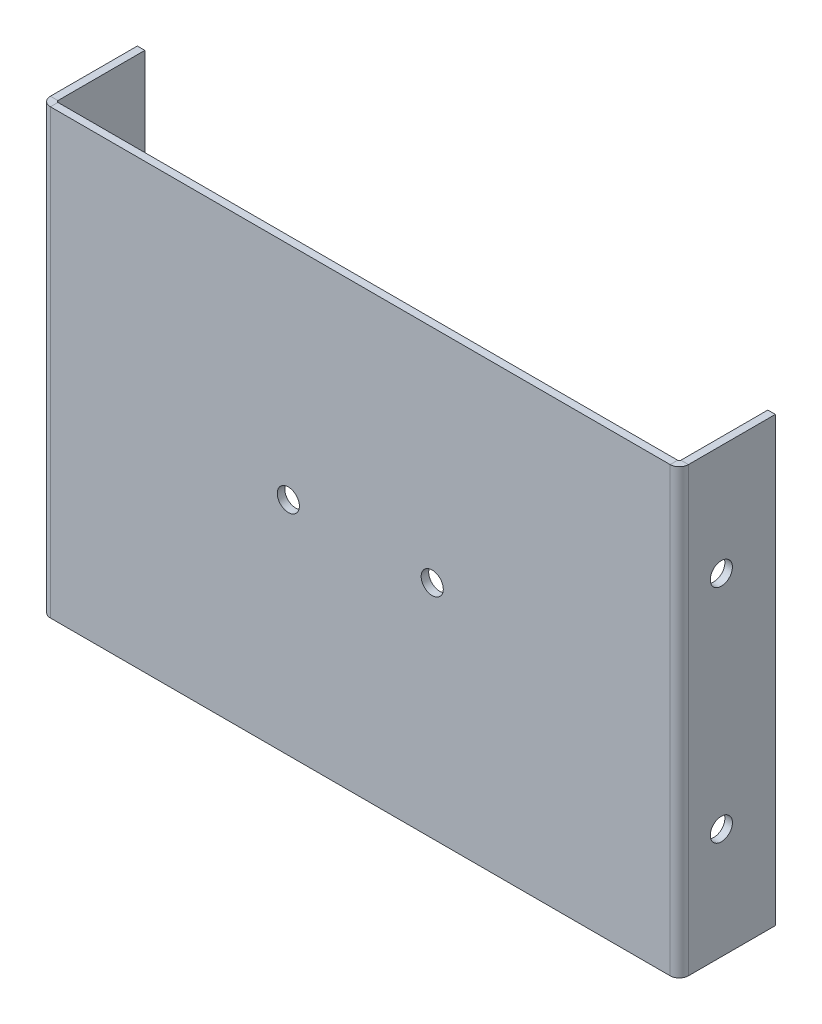
ISO-10303-21;
HEADER;
FILE_DESCRIPTION(('STEP AP214'),'2;1');
FILE_NAME('part.step','',(''),(''),'','','');
FILE_SCHEMA(('AUTOMOTIVE_DESIGN { 1 0 10303 214 1 1 1 1 }'));
ENDSEC;
DATA;
#1=APPLICATION_CONTEXT('core data for automotive mechanical design processes');
#2=APPLICATION_PROTOCOL_DEFINITION('international standard','automotive_design',2000,#1);
#3=PRODUCT_CONTEXT('',#1,'mechanical');
#4=PRODUCT('Part','Part','',(#3));
#5=PRODUCT_RELATED_PRODUCT_CATEGORY('part','',(#4));
#6=PRODUCT_DEFINITION_FORMATION('','',#4);
#7=PRODUCT_DEFINITION_CONTEXT('part definition',#1,'design');
#8=PRODUCT_DEFINITION('design','',#6,#7);
#9=PRODUCT_DEFINITION_SHAPE('','',#8);
#10=(LENGTH_UNIT() NAMED_UNIT(*) SI_UNIT(.MILLI.,.METRE.));
#11=(NAMED_UNIT(*) PLANE_ANGLE_UNIT() SI_UNIT($,.RADIAN.));
#12=(NAMED_UNIT(*) SI_UNIT($,.STERADIAN.) SOLID_ANGLE_UNIT());
#13=UNCERTAINTY_MEASURE_WITH_UNIT(LENGTH_MEASURE(1.E-05),#10,'distance_accuracy_value','');
#14=(GEOMETRIC_REPRESENTATION_CONTEXT(3) GLOBAL_UNCERTAINTY_ASSIGNED_CONTEXT((#13)) GLOBAL_UNIT_ASSIGNED_CONTEXT((#10,
#11,#12)) REPRESENTATION_CONTEXT('',''));
#15=CARTESIAN_POINT('',(0.,0.,0.));
#16=DIRECTION('',(0.,0.,1.));
#17=DIRECTION('',(1.,0.,0.));
#18=AXIS2_PLACEMENT_3D('',#15,#16,#17);
#19=CARTESIAN_POINT('',(0.,0.,-3.4));
#20=DIRECTION('',(0.,0.,-1.));
#21=DIRECTION('',(-1.,0.,0.));
#22=AXIS2_PLACEMENT_3D('',#19,#20,#21);
#23=PLANE('',#22);
#24=CARTESIAN_POINT('',(-176.6,-100.,-3.4));
#25=DIRECTION('',(0.,0.,1.));
#26=DIRECTION('',(-1.,0.,0.));
#27=AXIS2_PLACEMENT_3D('',#24,#25,#26);
#28=CIRCLE('',#27,5.00000000000002);
#29=CARTESIAN_POINT('',(-181.6,-100.,-3.4));
#30=VERTEX_POINT('',#29);
#31=EDGE_CURVE('E326',#30,#30,#28,.T.);
#32=ORIENTED_EDGE('',*,*,#31,.T.);
#33=EDGE_LOOP('',(#32));
#34=FACE_BOUND('',#33,.T.);
#35=CARTESIAN_POINT('',(-111.6,-100.,-3.4));
#36=DIRECTION('',(0.,0.,1.));
#37=DIRECTION('',(1.,0.,0.));
#38=AXIS2_PLACEMENT_3D('',#35,#36,#37);
#39=CIRCLE('',#38,5.00000000000001);
#40=CARTESIAN_POINT('',(-106.6,-100.,-3.4));
#41=VERTEX_POINT('',#40);
#42=EDGE_CURVE('E332',#41,#41,#39,.T.);
#43=ORIENTED_EDGE('',*,*,#42,.T.);
#44=EDGE_LOOP('',(#43));
#45=FACE_BOUND('',#44,.T.);
#46=DIRECTION('',(1.,0.,0.));
#47=VECTOR('',#46,1.);
#48=CARTESIAN_POINT('',(0.,-200.,-3.4));
#49=LINE('',#48,#47);
#50=CARTESIAN_POINT('',(-284.0634,-200.,-3.40000000000002));
#51=VERTEX_POINT('',#50);
#52=CARTESIAN_POINT('',(-4.13659999999997,-200.,-3.4));
#53=VERTEX_POINT('',#52);
#54=EDGE_CURVE('E13',#51,#53,#49,.T.);
#55=ORIENTED_EDGE('',*,*,#54,.F.);
#56=DIRECTION('',(0.,1.,0.));
#57=VECTOR('',#56,1.);
#58=CARTESIAN_POINT('',(-284.0634,0.,-3.40000000000002));
#59=LINE('',#58,#57);
#60=CARTESIAN_POINT('',(-284.0634,0.,-3.40000000000002));
#61=VERTEX_POINT('',#60);
#62=EDGE_CURVE('E254',#61,#51,#59,.F.);
#63=ORIENTED_EDGE('',*,*,#62,.F.);
#64=DIRECTION('',(-1.,0.,0.));
#65=VECTOR('',#64,1.);
#66=CARTESIAN_POINT('',(-288.2,0.,-3.4));
#67=LINE('',#66,#65);
#68=CARTESIAN_POINT('',(-4.13659999999999,0.,-3.4));
#69=VERTEX_POINT('',#68);
#70=EDGE_CURVE('E102',#69,#61,#67,.T.);
#71=ORIENTED_EDGE('',*,*,#70,.F.);
#72=DIRECTION('',(0.,-1.,0.));
#73=VECTOR('',#72,1.);
#74=CARTESIAN_POINT('',(-4.13659999999997,-200.,-3.40000000000001));
#75=LINE('',#74,#73);
#76=EDGE_CURVE('E318',#53,#69,#75,.F.);
#77=ORIENTED_EDGE('',*,*,#76,.F.);
#78=EDGE_LOOP('',(#55,#63,#71,#77));
#79=FACE_BOUND('',#78,.T.);
#80=ADVANCED_FACE('F93',(#34,#45,#79),#23,.T.);
#81=CARTESIAN_POINT('',(0.,0.,0.));
#82=DIRECTION('',(0.,0.,-1.));
#83=DIRECTION('',(-1.,0.,0.));
#84=AXIS2_PLACEMENT_3D('',#81,#82,#83);
#85=PLANE('',#84);
#86=CARTESIAN_POINT('',(-176.6,-100.,0.));
#87=DIRECTION('',(0.,0.,1.));
#88=DIRECTION('',(-1.,0.,0.));
#89=AXIS2_PLACEMENT_3D('',#86,#87,#88);
#90=CIRCLE('',#89,5.00000000000002);
#91=CARTESIAN_POINT('',(-181.6,-100.,0.));
#92=VERTEX_POINT('',#91);
#93=EDGE_CURVE('E324',#92,#92,#90,.T.);
#94=ORIENTED_EDGE('',*,*,#93,.F.);
#95=EDGE_LOOP('',(#94));
#96=FACE_BOUND('',#95,.T.);
#97=CARTESIAN_POINT('',(-111.6,-100.,0.));
#98=DIRECTION('',(0.,0.,1.));
#99=DIRECTION('',(1.,0.,0.));
#100=AXIS2_PLACEMENT_3D('',#97,#98,#99);
#101=CIRCLE('',#100,5.00000000000001);
#102=CARTESIAN_POINT('',(-106.6,-100.,0.));
#103=VERTEX_POINT('',#102);
#104=EDGE_CURVE('E329',#103,#103,#101,.T.);
#105=ORIENTED_EDGE('',*,*,#104,.F.);
#106=EDGE_LOOP('',(#105));
#107=FACE_BOUND('',#106,.T.);
#108=DIRECTION('',(0.,1.,0.));
#109=VECTOR('',#108,1.);
#110=CARTESIAN_POINT('',(-284.0634,0.,0.));
#111=LINE('',#110,#109);
#112=CARTESIAN_POINT('',(-284.0634,0.,0.));
#113=VERTEX_POINT('',#112);
#114=CARTESIAN_POINT('',(-284.0634,-200.,0.));
#115=VERTEX_POINT('',#114);
#116=EDGE_CURVE('E192',#113,#115,#111,.F.);
#117=ORIENTED_EDGE('',*,*,#116,.T.);
#118=DIRECTION('',(1.,0.,0.));
#119=VECTOR('',#118,1.);
#120=CARTESIAN_POINT('',(0.,-200.,0.));
#121=LINE('',#120,#119);
#122=CARTESIAN_POINT('',(-4.13659999999992,-200.,0.));
#123=VERTEX_POINT('',#122);
#124=EDGE_CURVE('E97',#115,#123,#121,.T.);
#125=ORIENTED_EDGE('',*,*,#124,.T.);
#126=DIRECTION('',(0.,-1.,0.));
#127=VECTOR('',#126,1.);
#128=CARTESIAN_POINT('',(-4.13659999999992,-200.,0.));
#129=LINE('',#128,#127);
#130=CARTESIAN_POINT('',(-4.13659999999999,0.,0.));
#131=VERTEX_POINT('',#130);
#132=EDGE_CURVE('E306',#123,#131,#129,.F.);
#133=ORIENTED_EDGE('',*,*,#132,.T.);
#134=DIRECTION('',(-1.,0.,0.));
#135=VECTOR('',#134,1.);
#136=CARTESIAN_POINT('',(-288.2,0.,0.));
#137=LINE('',#136,#135);
#138=EDGE_CURVE('E335',#131,#113,#137,.T.);
#139=ORIENTED_EDGE('',*,*,#138,.T.);
#140=EDGE_LOOP('',(#117,#125,#133,#139));
#141=FACE_BOUND('',#140,.T.);
#142=ADVANCED_FACE('F340',(#96,#107,#141),#85,.F.);
#143=CARTESIAN_POINT('',(-288.2,0.,-3.4));
#144=DIRECTION('',(0.,1.,0.));
#145=DIRECTION('',(0.,0.,1.));
#146=AXIS2_PLACEMENT_3D('',#143,#144,#145);
#147=PLANE('',#146);
#148=ORIENTED_EDGE('',*,*,#70,.T.);
#149=DIRECTION('',(0.,0.,1.));
#150=VECTOR('',#149,1.);
#151=CARTESIAN_POINT('',(-284.0634,0.,-3.40000000000002));
#152=LINE('',#151,#150);
#153=EDGE_CURVE('E250',#61,#113,#152,.T.);
#154=ORIENTED_EDGE('',*,*,#153,.T.);
#155=ORIENTED_EDGE('',*,*,#138,.F.);
#156=DIRECTION('',(0.,0.,1.));
#157=VECTOR('',#156,1.);
#158=CARTESIAN_POINT('',(-4.13659999999997,0.,-3.40000000000001));
#159=LINE('',#158,#157);
#160=EDGE_CURVE('E116',#69,#131,#159,.T.);
#161=ORIENTED_EDGE('',*,*,#160,.F.);
#162=EDGE_LOOP('',(#148,#154,#155,#161));
#163=FACE_BOUND('',#162,.T.);
#164=ADVANCED_FACE('F95',(#163),#147,.T.);
#165=CARTESIAN_POINT('',(0.,-200.,-3.4));
#166=DIRECTION('',(0.,-1.,0.));
#167=DIRECTION('',(1.,0.,0.));
#168=AXIS2_PLACEMENT_3D('',#165,#166,#167);
#169=PLANE('',#168);
#170=DIRECTION('',(0.,0.,1.));
#171=VECTOR('',#170,1.);
#172=CARTESIAN_POINT('',(-284.0634,-200.,-3.40000000000002));
#173=LINE('',#172,#171);
#174=EDGE_CURVE('E258',#51,#115,#173,.T.);
#175=ORIENTED_EDGE('',*,*,#174,.F.);
#176=ORIENTED_EDGE('',*,*,#54,.T.);
#177=DIRECTION('',(0.,0.,1.));
#178=VECTOR('',#177,1.);
#179=CARTESIAN_POINT('',(-4.13659999999997,-200.,-3.40000000000001));
#180=LINE('',#179,#178);
#181=EDGE_CURVE('E312',#53,#123,#180,.T.);
#182=ORIENTED_EDGE('',*,*,#181,.T.);
#183=ORIENTED_EDGE('',*,*,#124,.F.);
#184=EDGE_LOOP('',(#175,#176,#182,#183));
#185=FACE_BOUND('',#184,.T.);
#186=ADVANCED_FACE('F343',(#185),#169,.T.);
#187=CARTESIAN_POINT('',(-111.6,-100.,-3.4));
#188=DIRECTION('',(0.,0.,1.));
#189=DIRECTION('',(1.,0.,0.));
#190=AXIS2_PLACEMENT_3D('',#187,#188,#189);
#191=CYLINDRICAL_SURFACE('',#190,5.00000000000001);
#192=ORIENTED_EDGE('',*,*,#42,.F.);
#193=EDGE_LOOP('',(#192));
#194=FACE_BOUND('',#193,.T.);
#195=ORIENTED_EDGE('',*,*,#104,.T.);
#196=EDGE_LOOP('',(#195));
#197=FACE_BOUND('',#196,.T.);
#198=ADVANCED_FACE('F416',(#194,#197),#191,.F.);
#199=CARTESIAN_POINT('',(-176.6,-100.,-3.4));
#200=DIRECTION('',(0.,0.,1.));
#201=DIRECTION('',(1.,0.,0.));
#202=AXIS2_PLACEMENT_3D('',#199,#200,#201);
#203=CYLINDRICAL_SURFACE('',#202,5.00000000000002);
#204=ORIENTED_EDGE('',*,*,#31,.F.);
#205=EDGE_LOOP('',(#204));
#206=FACE_BOUND('',#205,.T.);
#207=ORIENTED_EDGE('',*,*,#93,.T.);
#208=EDGE_LOOP('',(#207));
#209=FACE_BOUND('',#208,.T.);
#210=ADVANCED_FACE('F423',(#206,#209),#203,.F.);
#211=CARTESIAN_POINT('',(-4.13659999999999,0.,-4.1366));
#212=DIRECTION('',(0.,1.,0.));
#213=DIRECTION('',(0.,0.,1.));
#214=AXIS2_PLACEMENT_3D('',#211,#212,#213);
#215=PLANE('',#214);
#216=DIRECTION('',(-1.,0.,0.));
#217=VECTOR('',#216,1.);
#218=CARTESIAN_POINT('',(0.,0.,-4.13659999999999));
#219=LINE('',#218,#217);
#220=CARTESIAN_POINT('',(-3.4,0.,-4.13659999999999));
#221=VERTEX_POINT('',#220);
#222=CARTESIAN_POINT('',(0.,0.,-4.13659999999998));
#223=VERTEX_POINT('',#222);
#224=EDGE_CURVE('E261',#221,#223,#219,.F.);
#225=ORIENTED_EDGE('',*,*,#224,.F.);
#226=CARTESIAN_POINT('',(-4.13659999999999,0.,-4.1366));
#227=DIRECTION('',(0.,-1.,0.));
#228=DIRECTION('',(0.,0.,-1.));
#229=AXIS2_PLACEMENT_3D('',#226,#227,#228);
#230=CIRCLE('',#229,0.736599999999988);
#231=EDGE_CURVE('E315',#69,#221,#230,.F.);
#232=ORIENTED_EDGE('',*,*,#231,.F.);
#233=ORIENTED_EDGE('',*,*,#160,.T.);
#234=CARTESIAN_POINT('',(-4.13659999999999,0.,-4.1366));
#235=DIRECTION('',(0.,-1.,0.));
#236=DIRECTION('',(0.,0.,-1.));
#237=AXIS2_PLACEMENT_3D('',#234,#235,#236);
#238=CIRCLE('',#237,4.13659999999999);
#239=EDGE_CURVE('E308',#131,#223,#238,.F.);
#240=ORIENTED_EDGE('',*,*,#239,.T.);
#241=EDGE_LOOP('',(#225,#232,#233,#240));
#242=FACE_BOUND('',#241,.T.);
#243=ADVANCED_FACE('F371',(#242),#215,.T.);
#244=CARTESIAN_POINT('',(-4.13659999999999,-200.,-4.1366));
#245=DIRECTION('',(0.,1.,0.));
#246=DIRECTION('',(0.,0.,1.));
#247=AXIS2_PLACEMENT_3D('',#244,#245,#246);
#248=PLANE('',#247);
#249=CARTESIAN_POINT('',(-4.13659999999999,-200.,-4.1366));
#250=DIRECTION('',(0.,-1.,0.));
#251=DIRECTION('',(0.,0.,-1.));
#252=AXIS2_PLACEMENT_3D('',#249,#250,#251);
#253=CIRCLE('',#252,0.736599999999988);
#254=CARTESIAN_POINT('',(-3.4,-200.,-4.13659999999999));
#255=VERTEX_POINT('',#254);
#256=EDGE_CURVE('E267',#255,#53,#253,.T.);
#257=ORIENTED_EDGE('',*,*,#256,.F.);
#258=DIRECTION('',(-1.,0.,0.));
#259=VECTOR('',#258,1.);
#260=CARTESIAN_POINT('',(-3.39999999999997,-200.,-4.13659999999999));
#261=LINE('',#260,#259);
#262=CARTESIAN_POINT('',(0.,-200.,-4.13659999999998));
#263=VERTEX_POINT('',#262);
#264=EDGE_CURVE('E299',#255,#263,#261,.F.);
#265=ORIENTED_EDGE('',*,*,#264,.T.);
#266=CARTESIAN_POINT('',(-4.13659999999999,-200.,-4.1366));
#267=DIRECTION('',(0.,-1.,0.));
#268=DIRECTION('',(0.,0.,-1.));
#269=AXIS2_PLACEMENT_3D('',#266,#267,#268);
#270=CIRCLE('',#269,4.13659999999999);
#271=EDGE_CURVE('E309',#263,#123,#270,.T.);
#272=ORIENTED_EDGE('',*,*,#271,.T.);
#273=ORIENTED_EDGE('',*,*,#181,.F.);
#274=EDGE_LOOP('',(#257,#265,#272,#273));
#275=FACE_BOUND('',#274,.T.);
#276=ADVANCED_FACE('F349',(#275),#248,.F.);
#277=CARTESIAN_POINT('',(-4.13659999999999,-200.,-4.1366));
#278=DIRECTION('',(0.,-1.,0.));
#279=DIRECTION('',(1.,0.,0.));
#280=AXIS2_PLACEMENT_3D('',#277,#278,#279);
#281=CYLINDRICAL_SURFACE('',#280,4.13659999999999);
#282=ORIENTED_EDGE('',*,*,#132,.F.);
#283=ORIENTED_EDGE('',*,*,#271,.F.);
#284=DIRECTION('',(0.,-1.,0.));
#285=VECTOR('',#284,1.);
#286=CARTESIAN_POINT('',(0.,0.,-4.13659999999999));
#287=LINE('',#286,#285);
#288=EDGE_CURVE('E297',#263,#223,#287,.F.);
#289=ORIENTED_EDGE('',*,*,#288,.T.);
#290=ORIENTED_EDGE('',*,*,#239,.F.);
#291=EDGE_LOOP('',(#282,#283,#289,#290));
#292=FACE_BOUND('',#291,.T.);
#293=ADVANCED_FACE('F348',(#292),#281,.T.);
#294=CARTESIAN_POINT('',(-4.13659999999999,-200.,-4.1366));
#295=DIRECTION('',(0.,-1.,0.));
#296=DIRECTION('',(1.,0.,0.));
#297=AXIS2_PLACEMENT_3D('',#294,#295,#296);
#298=CYLINDRICAL_SURFACE('',#297,0.736599999999988);
#299=ORIENTED_EDGE('',*,*,#76,.T.);
#300=ORIENTED_EDGE('',*,*,#231,.T.);
#301=DIRECTION('',(0.,-1.,0.));
#302=VECTOR('',#301,1.);
#303=CARTESIAN_POINT('',(-3.4,0.,-4.1366));
#304=LINE('',#303,#302);
#305=EDGE_CURVE('E302',#221,#255,#304,.T.);
#306=ORIENTED_EDGE('',*,*,#305,.T.);
#307=ORIENTED_EDGE('',*,*,#256,.T.);
#308=EDGE_LOOP('',(#299,#300,#306,#307));
#309=FACE_BOUND('',#308,.T.);
#310=ADVANCED_FACE('F373',(#309),#298,.F.);
#311=CARTESIAN_POINT('',(0.,0.,0.));
#312=DIRECTION('',(-1.,0.,0.));
#313=DIRECTION('',(0.,0.,1.));
#314=AXIS2_PLACEMENT_3D('',#311,#312,#313);
#315=PLANE('',#314);
#316=CARTESIAN_POINT('',(0.,-150.,-19.));
#317=DIRECTION('',(-1.,0.,0.));
#318=DIRECTION('',(0.,0.,1.));
#319=AXIS2_PLACEMENT_3D('',#316,#317,#318);
#320=CIRCLE('',#319,4.99999999999999);
#321=CARTESIAN_POINT('',(0.,-150.,-14.));
#322=VERTEX_POINT('',#321);
#323=EDGE_CURVE('E291',#322,#322,#320,.F.);
#324=ORIENTED_EDGE('',*,*,#323,.F.);
#325=EDGE_LOOP('',(#324));
#326=FACE_BOUND('',#325,.T.);
#327=CARTESIAN_POINT('',(0.,-50.,-19.));
#328=DIRECTION('',(-1.,0.,0.));
#329=DIRECTION('',(0.,0.,1.));
#330=AXIS2_PLACEMENT_3D('',#327,#328,#329);
#331=CIRCLE('',#330,5.);
#332=CARTESIAN_POINT('',(0.,-50.,-14.));
#333=VERTEX_POINT('',#332);
#334=EDGE_CURVE('E285',#333,#333,#331,.F.);
#335=ORIENTED_EDGE('',*,*,#334,.F.);
#336=EDGE_LOOP('',(#335));
#337=FACE_BOUND('',#336,.T.);
#338=ORIENTED_EDGE('',*,*,#288,.F.);
#339=DIRECTION('',(0.,0.,-1.));
#340=VECTOR('',#339,1.);
#341=CARTESIAN_POINT('',(0.,-200.,0.));
#342=LINE('',#341,#340);
#343=CARTESIAN_POINT('',(1.64313842625896E-13,-200.,-43.4));
#344=VERTEX_POINT('',#343);
#345=EDGE_CURVE('E276',#263,#344,#342,.T.);
#346=ORIENTED_EDGE('',*,*,#345,.T.);
#347=DIRECTION('',(0.,1.,0.));
#348=VECTOR('',#347,1.);
#349=CARTESIAN_POINT('',(1.39820906642948E-13,0.,-43.4));
#350=LINE('',#349,#348);
#351=CARTESIAN_POINT('',(1.39820906642948E-13,0.,-43.4));
#352=VERTEX_POINT('',#351);
#353=EDGE_CURVE('E274',#344,#352,#350,.T.);
#354=ORIENTED_EDGE('',*,*,#353,.T.);
#355=DIRECTION('',(0.,0.,1.));
#356=VECTOR('',#355,1.);
#357=CARTESIAN_POINT('',(0.,0.,0.));
#358=LINE('',#357,#356);
#359=EDGE_CURVE('E271',#352,#223,#358,.T.);
#360=ORIENTED_EDGE('',*,*,#359,.T.);
#361=EDGE_LOOP('',(#338,#346,#354,#360));
#362=FACE_BOUND('',#361,.T.);
#363=ADVANCED_FACE('F356',(#326,#337,#362),#315,.F.);
#364=CARTESIAN_POINT('',(-3.40000000000001,0.,0.));
#365=DIRECTION('',(-1.,0.,0.));
#366=DIRECTION('',(0.,0.,1.));
#367=AXIS2_PLACEMENT_3D('',#364,#365,#366);
#368=PLANE('',#367);
#369=CARTESIAN_POINT('',(-3.39999999999994,-50.,-19.));
#370=DIRECTION('',(-1.,0.,0.));
#371=DIRECTION('',(0.,0.,1.));
#372=AXIS2_PLACEMENT_3D('',#369,#370,#371);
#373=CIRCLE('',#372,5.);
#374=CARTESIAN_POINT('',(-3.39999999999996,-50.,-14.));
#375=VERTEX_POINT('',#374);
#376=EDGE_CURVE('E288',#375,#375,#373,.F.);
#377=ORIENTED_EDGE('',*,*,#376,.T.);
#378=EDGE_LOOP('',(#377));
#379=FACE_BOUND('',#378,.T.);
#380=CARTESIAN_POINT('',(-3.39999999999993,-150.,-19.));
#381=DIRECTION('',(-1.,0.,0.));
#382=DIRECTION('',(0.,0.,1.));
#383=AXIS2_PLACEMENT_3D('',#380,#381,#382);
#384=CIRCLE('',#383,4.99999999999999);
#385=CARTESIAN_POINT('',(-3.39999999999994,-150.,-14.));
#386=VERTEX_POINT('',#385);
#387=EDGE_CURVE('E294',#386,#386,#384,.F.);
#388=ORIENTED_EDGE('',*,*,#387,.T.);
#389=EDGE_LOOP('',(#388));
#390=FACE_BOUND('',#389,.T.);
#391=DIRECTION('',(0.,0.,1.));
#392=VECTOR('',#391,1.);
#393=CARTESIAN_POINT('',(-3.39999999999984,-200.,-43.4));
#394=LINE('',#393,#392);
#395=CARTESIAN_POINT('',(-3.39999999999984,-200.,-43.4));
#396=VERTEX_POINT('',#395);
#397=EDGE_CURVE('E283',#255,#396,#394,.F.);
#398=ORIENTED_EDGE('',*,*,#397,.F.);
#399=ORIENTED_EDGE('',*,*,#305,.F.);
#400=DIRECTION('',(0.,0.,-1.));
#401=VECTOR('',#400,1.);
#402=CARTESIAN_POINT('',(-3.4,0.,-3.4));
#403=LINE('',#402,#401);
#404=CARTESIAN_POINT('',(-3.39999999999986,0.,-43.4));
#405=VERTEX_POINT('',#404);
#406=EDGE_CURVE('E278',#405,#221,#403,.F.);
#407=ORIENTED_EDGE('',*,*,#406,.F.);
#408=DIRECTION('',(0.,-1.,0.));
#409=VECTOR('',#408,1.);
#410=CARTESIAN_POINT('',(-3.39999999999986,0.,-43.4));
#411=LINE('',#410,#409);
#412=EDGE_CURVE('E281',#396,#405,#411,.F.);
#413=ORIENTED_EDGE('',*,*,#412,.F.);
#414=EDGE_LOOP('',(#398,#399,#407,#413));
#415=FACE_BOUND('',#414,.T.);
#416=ADVANCED_FACE('F483',(#379,#390,#415),#368,.T.);
#417=CARTESIAN_POINT('',(1.64365049348802E-13,-200.,-43.4));
#418=DIRECTION('',(0.,1.,0.));
#419=DIRECTION('',(-1.,0.,0.));
#420=AXIS2_PLACEMENT_3D('',#417,#418,#419);
#421=PLANE('',#420);
#422=ORIENTED_EDGE('',*,*,#264,.F.);
#423=ORIENTED_EDGE('',*,*,#397,.T.);
#424=DIRECTION('',(-1.,0.,0.));
#425=VECTOR('',#424,1.);
#426=CARTESIAN_POINT('',(1.6413817579908E-13,-200.,-43.4));
#427=LINE('',#426,#425);
#428=EDGE_CURVE('E264',#344,#396,#427,.T.);
#429=ORIENTED_EDGE('',*,*,#428,.F.);
#430=ORIENTED_EDGE('',*,*,#345,.F.);
#431=EDGE_LOOP('',(#422,#423,#429,#430));
#432=FACE_BOUND('',#431,.T.);
#433=ADVANCED_FACE('F360',(#432),#421,.F.);
#434=CARTESIAN_POINT('',(0.,0.,-3.39999999999999));
#435=DIRECTION('',(0.,-1.,0.));
#436=DIRECTION('',(1.,0.,0.));
#437=AXIS2_PLACEMENT_3D('',#434,#435,#436);
#438=PLANE('',#437);
#439=ORIENTED_EDGE('',*,*,#224,.T.);
#440=ORIENTED_EDGE('',*,*,#359,.F.);
#441=DIRECTION('',(-1.,0.,0.));
#442=VECTOR('',#441,1.);
#443=CARTESIAN_POINT('',(1.39659253553725E-13,0.,-43.4));
#444=LINE('',#443,#442);
#445=EDGE_CURVE('E268',#352,#405,#444,.T.);
#446=ORIENTED_EDGE('',*,*,#445,.T.);
#447=ORIENTED_EDGE('',*,*,#406,.T.);
#448=EDGE_LOOP('',(#439,#440,#446,#447));
#449=FACE_BOUND('',#448,.T.);
#450=ADVANCED_FACE('F367',(#449),#438,.F.);
#451=CARTESIAN_POINT('',(1.39645239816133E-13,0.,-43.4));
#452=DIRECTION('',(0.,0.,1.));
#453=DIRECTION('',(1.,0.,0.));
#454=AXIS2_PLACEMENT_3D('',#451,#452,#453);
#455=PLANE('',#454);
#456=ORIENTED_EDGE('',*,*,#412,.T.);
#457=ORIENTED_EDGE('',*,*,#445,.F.);
#458=ORIENTED_EDGE('',*,*,#353,.F.);
#459=ORIENTED_EDGE('',*,*,#428,.T.);
#460=EDGE_LOOP('',(#456,#457,#458,#459));
#461=FACE_BOUND('',#460,.T.);
#462=ADVANCED_FACE('F363',(#461),#455,.F.);
#463=CARTESIAN_POINT('',(0.,-50.,-19.));
#464=DIRECTION('',(-1.,0.,0.));
#465=DIRECTION('',(0.,0.,1.));
#466=AXIS2_PLACEMENT_3D('',#463,#464,#465);
#467=CYLINDRICAL_SURFACE('',#466,5.);
#468=ORIENTED_EDGE('',*,*,#334,.T.);
#469=EDGE_LOOP('',(#468));
#470=FACE_BOUND('',#469,.T.);
#471=ORIENTED_EDGE('',*,*,#376,.F.);
#472=EDGE_LOOP('',(#471));
#473=FACE_BOUND('',#472,.T.);
#474=ADVANCED_FACE('F402',(#470,#473),#467,.F.);
#475=CARTESIAN_POINT('',(0.,-150.,-19.));
#476=DIRECTION('',(-1.,0.,0.));
#477=DIRECTION('',(0.,0.,1.));
#478=AXIS2_PLACEMENT_3D('',#475,#476,#477);
#479=CYLINDRICAL_SURFACE('',#478,4.99999999999999);
#480=ORIENTED_EDGE('',*,*,#323,.T.);
#481=EDGE_LOOP('',(#480));
#482=FACE_BOUND('',#481,.T.);
#483=ORIENTED_EDGE('',*,*,#387,.F.);
#484=EDGE_LOOP('',(#483));
#485=FACE_BOUND('',#484,.T.);
#486=ADVANCED_FACE('F395',(#482,#485),#479,.F.);
#487=CARTESIAN_POINT('',(-284.0634,-200.,-4.13659999999999));
#488=DIRECTION('',(0.,-1.,0.));
#489=DIRECTION('',(0.,0.,-1.));
#490=AXIS2_PLACEMENT_3D('',#487,#488,#489);
#491=PLANE('',#490);
#492=DIRECTION('',(1.,0.,0.));
#493=VECTOR('',#492,1.);
#494=CARTESIAN_POINT('',(-288.2,-200.,-4.13659999999998));
#495=LINE('',#494,#493);
#496=CARTESIAN_POINT('',(-284.8,-200.,-4.13659999999999));
#497=VERTEX_POINT('',#496);
#498=CARTESIAN_POINT('',(-288.2,-200.,-4.13659999999997));
#499=VERTEX_POINT('',#498);
#500=EDGE_CURVE('E245',#497,#499,#495,.F.);
#501=ORIENTED_EDGE('',*,*,#500,.F.);
#502=CARTESIAN_POINT('',(-284.0634,-200.,-4.13659999999999));
#503=DIRECTION('',(0.,1.,0.));
#504=DIRECTION('',(0.,0.,1.));
#505=AXIS2_PLACEMENT_3D('',#502,#503,#504);
#506=CIRCLE('',#505,0.736599999999976);
#507=EDGE_CURVE('E195',#51,#497,#506,.F.);
#508=ORIENTED_EDGE('',*,*,#507,.F.);
#509=ORIENTED_EDGE('',*,*,#174,.T.);
#510=CARTESIAN_POINT('',(-284.0634,-200.,-4.13659999999999));
#511=DIRECTION('',(0.,1.,0.));
#512=DIRECTION('',(0.,0.,1.));
#513=AXIS2_PLACEMENT_3D('',#510,#511,#512);
#514=CIRCLE('',#513,4.13659999999998);
#515=EDGE_CURVE('E249',#115,#499,#514,.F.);
#516=ORIENTED_EDGE('',*,*,#515,.T.);
#517=EDGE_LOOP('',(#501,#508,#509,#516));
#518=FACE_BOUND('',#517,.T.);
#519=ADVANCED_FACE('F393',(#518),#491,.T.);
#520=CARTESIAN_POINT('',(-284.0634,0.,-4.13659999999999));
#521=DIRECTION('',(0.,-1.,0.));
#522=DIRECTION('',(0.,0.,-1.));
#523=AXIS2_PLACEMENT_3D('',#520,#521,#522);
#524=PLANE('',#523);
#525=CARTESIAN_POINT('',(-284.0634,0.,-4.13659999999999));
#526=DIRECTION('',(0.,1.,0.));
#527=DIRECTION('',(0.,0.,1.));
#528=AXIS2_PLACEMENT_3D('',#525,#526,#527);
#529=CIRCLE('',#528,0.736599999999976);
#530=CARTESIAN_POINT('',(-284.8,0.,-4.13659999999999));
#531=VERTEX_POINT('',#530);
#532=EDGE_CURVE('E202',#531,#61,#529,.T.);
#533=ORIENTED_EDGE('',*,*,#532,.F.);
#534=DIRECTION('',(1.,0.,0.));
#535=VECTOR('',#534,1.);
#536=CARTESIAN_POINT('',(-284.8,0.,-4.13659999999999));
#537=LINE('',#536,#535);
#538=CARTESIAN_POINT('',(-288.2,0.,-4.13659999999998));
#539=VERTEX_POINT('',#538);
#540=EDGE_CURVE('E199',#531,#539,#537,.F.);
#541=ORIENTED_EDGE('',*,*,#540,.T.);
#542=CARTESIAN_POINT('',(-284.0634,0.,-4.13659999999999));
#543=DIRECTION('',(0.,1.,0.));
#544=DIRECTION('',(0.,0.,1.));
#545=AXIS2_PLACEMENT_3D('',#542,#543,#544);
#546=CIRCLE('',#545,4.13659999999998);
#547=EDGE_CURVE('E185',#539,#113,#546,.T.);
#548=ORIENTED_EDGE('',*,*,#547,.T.);
#549=ORIENTED_EDGE('',*,*,#153,.F.);
#550=EDGE_LOOP('',(#533,#541,#548,#549));
#551=FACE_BOUND('',#550,.T.);
#552=ADVANCED_FACE('F200',(#551),#524,.F.);
#553=CARTESIAN_POINT('',(-284.0634,0.,-4.13659999999999));
#554=DIRECTION('',(0.,1.,0.));
#555=DIRECTION('',(-1.,0.,0.));
#556=AXIS2_PLACEMENT_3D('',#553,#554,#555);
#557=CYLINDRICAL_SURFACE('',#556,4.13659999999998);
#558=ORIENTED_EDGE('',*,*,#116,.F.);
#559=ORIENTED_EDGE('',*,*,#547,.F.);
#560=DIRECTION('',(0.,1.,0.));
#561=VECTOR('',#560,1.);
#562=CARTESIAN_POINT('',(-288.2,-200.,-4.13659999999998));
#563=LINE('',#562,#561);
#564=EDGE_CURVE('E190',#539,#499,#563,.F.);
#565=ORIENTED_EDGE('',*,*,#564,.T.);
#566=ORIENTED_EDGE('',*,*,#515,.F.);
#567=EDGE_LOOP('',(#558,#559,#565,#566));
#568=FACE_BOUND('',#567,.T.);
#569=ADVANCED_FACE('F187',(#568),#557,.T.);
#570=CARTESIAN_POINT('',(-284.0634,0.,-4.13659999999999));
#571=DIRECTION('',(0.,1.,0.));
#572=DIRECTION('',(-1.,0.,0.));
#573=AXIS2_PLACEMENT_3D('',#570,#571,#572);
#574=CYLINDRICAL_SURFACE('',#573,0.736599999999976);
#575=ORIENTED_EDGE('',*,*,#62,.T.);
#576=ORIENTED_EDGE('',*,*,#507,.T.);
#577=DIRECTION('',(0.,1.,0.));
#578=VECTOR('',#577,1.);
#579=CARTESIAN_POINT('',(-284.8,-200.,-4.13659999999999));
#580=LINE('',#579,#578);
#581=EDGE_CURVE('E206',#497,#531,#580,.T.);
#582=ORIENTED_EDGE('',*,*,#581,.T.);
#583=ORIENTED_EDGE('',*,*,#532,.T.);
#584=EDGE_LOOP('',(#575,#576,#582,#583));
#585=FACE_BOUND('',#584,.T.);
#586=ADVANCED_FACE('F376',(#585),#574,.F.);
#587=CARTESIAN_POINT('',(-288.2,0.,1.21174457041571E-12));
#588=DIRECTION('',(1.,0.,0.));
#589=DIRECTION('',(0.,0.,-1.));
#590=AXIS2_PLACEMENT_3D('',#587,#588,#589);
#591=PLANE('',#590);
#592=CARTESIAN_POINT('',(-288.2,-150.,-19.));
#593=DIRECTION('',(1.,0.,0.));
#594=DIRECTION('',(0.,0.,-1.));
#595=AXIS2_PLACEMENT_3D('',#592,#593,#594);
#596=CIRCLE('',#595,4.99999999999999);
#597=CARTESIAN_POINT('',(-288.2,-150.,-24.));
#598=VERTEX_POINT('',#597);
#599=EDGE_CURVE('E239',#598,#598,#596,.F.);
#600=ORIENTED_EDGE('',*,*,#599,.F.);
#601=EDGE_LOOP('',(#600));
#602=FACE_BOUND('',#601,.T.);
#603=CARTESIAN_POINT('',(-288.2,-50.,-19.));
#604=DIRECTION('',(1.,0.,0.));
#605=DIRECTION('',(0.,0.,-1.));
#606=AXIS2_PLACEMENT_3D('',#603,#604,#605);
#607=CIRCLE('',#606,5.);
#608=CARTESIAN_POINT('',(-288.2,-50.,-24.));
#609=VERTEX_POINT('',#608);
#610=EDGE_CURVE('E233',#609,#609,#607,.F.);
#611=ORIENTED_EDGE('',*,*,#610,.F.);
#612=EDGE_LOOP('',(#611));
#613=FACE_BOUND('',#612,.T.);
#614=ORIENTED_EDGE('',*,*,#564,.F.);
#615=DIRECTION('',(0.,0.,-1.));
#616=VECTOR('',#615,1.);
#617=CARTESIAN_POINT('',(-288.2,0.,1.21174457041571E-12));
#618=LINE('',#617,#616);
#619=CARTESIAN_POINT('',(-288.2,0.,-43.4));
#620=VERTEX_POINT('',#619);
#621=EDGE_CURVE('E211',#539,#620,#618,.T.);
#622=ORIENTED_EDGE('',*,*,#621,.T.);
#623=DIRECTION('',(0.,-1.,0.));
#624=VECTOR('',#623,1.);
#625=CARTESIAN_POINT('',(-288.2,0.,-43.4));
#626=LINE('',#625,#624);
#627=CARTESIAN_POINT('',(-288.2,-200.,-43.4));
#628=VERTEX_POINT('',#627);
#629=EDGE_CURVE('E221',#620,#628,#626,.T.);
#630=ORIENTED_EDGE('',*,*,#629,.T.);
#631=DIRECTION('',(0.,0.,1.));
#632=VECTOR('',#631,1.);
#633=CARTESIAN_POINT('',(-288.2,-200.,1.21174457041571E-12));
#634=LINE('',#633,#632);
#635=EDGE_CURVE('E214',#628,#499,#634,.T.);
#636=ORIENTED_EDGE('',*,*,#635,.T.);
#637=EDGE_LOOP('',(#614,#622,#630,#636));
#638=FACE_BOUND('',#637,.T.);
#639=ADVANCED_FACE('F210',(#602,#613,#638),#591,.F.);
#640=CARTESIAN_POINT('',(-284.8,0.,1.19987353386364E-12));
#641=DIRECTION('',(1.,0.,0.));
#642=DIRECTION('',(0.,0.,-1.));
#643=AXIS2_PLACEMENT_3D('',#640,#641,#642);
#644=PLANE('',#643);
#645=CARTESIAN_POINT('',(-284.8,-50.,-19.));
#646=DIRECTION('',(1.,0.,0.));
#647=DIRECTION('',(0.,0.,-1.));
#648=AXIS2_PLACEMENT_3D('',#645,#646,#647);
#649=CIRCLE('',#648,5.);
#650=CARTESIAN_POINT('',(-284.8,-50.,-24.));
#651=VERTEX_POINT('',#650);
#652=EDGE_CURVE('E236',#651,#651,#649,.F.);
#653=ORIENTED_EDGE('',*,*,#652,.T.);
#654=EDGE_LOOP('',(#653));
#655=FACE_BOUND('',#654,.T.);
#656=CARTESIAN_POINT('',(-284.8,-150.,-19.));
#657=DIRECTION('',(1.,0.,0.));
#658=DIRECTION('',(0.,0.,-1.));
#659=AXIS2_PLACEMENT_3D('',#656,#657,#658);
#660=CIRCLE('',#659,4.99999999999999);
#661=CARTESIAN_POINT('',(-284.8,-150.,-24.));
#662=VERTEX_POINT('',#661);
#663=EDGE_CURVE('E215',#662,#662,#660,.F.);
#664=ORIENTED_EDGE('',*,*,#663,.T.);
#665=EDGE_LOOP('',(#664));
#666=FACE_BOUND('',#665,.T.);
#667=DIRECTION('',(0.,0.,1.));
#668=VECTOR('',#667,1.);
#669=CARTESIAN_POINT('',(-284.8,0.,-43.4));
#670=LINE('',#669,#668);
#671=CARTESIAN_POINT('',(-284.8,0.,-43.4));
#672=VERTEX_POINT('',#671);
#673=EDGE_CURVE('E231',#531,#672,#670,.F.);
#674=ORIENTED_EDGE('',*,*,#673,.F.);
#675=ORIENTED_EDGE('',*,*,#581,.F.);
#676=DIRECTION('',(0.,0.,-1.));
#677=VECTOR('',#676,1.);
#678=CARTESIAN_POINT('',(-284.8,-200.,-3.4));
#679=LINE('',#678,#677);
#680=CARTESIAN_POINT('',(-284.8,-200.,-43.4));
#681=VERTEX_POINT('',#680);
#682=EDGE_CURVE('E222',#681,#497,#679,.F.);
#683=ORIENTED_EDGE('',*,*,#682,.F.);
#684=DIRECTION('',(0.,1.,0.));
#685=VECTOR('',#684,1.);
#686=CARTESIAN_POINT('',(-284.8,-200.,-43.4));
#687=LINE('',#686,#685);
#688=EDGE_CURVE('E226',#672,#681,#687,.F.);
#689=ORIENTED_EDGE('',*,*,#688,.F.);
#690=EDGE_LOOP('',(#674,#675,#683,#689));
#691=FACE_BOUND('',#690,.T.);
#692=ADVANCED_FACE('F381',(#655,#666,#691),#644,.T.);
#693=CARTESIAN_POINT('',(-288.2,0.,-43.4));
#694=DIRECTION('',(0.,-1.,0.));
#695=DIRECTION('',(0.,0.,-1.));
#696=AXIS2_PLACEMENT_3D('',#693,#694,#695);
#697=PLANE('',#696);
#698=ORIENTED_EDGE('',*,*,#540,.F.);
#699=ORIENTED_EDGE('',*,*,#673,.T.);
#700=DIRECTION('',(1.,0.,0.));
#701=VECTOR('',#700,1.);
#702=CARTESIAN_POINT('',(-288.2,0.,-43.4));
#703=LINE('',#702,#701);
#704=EDGE_CURVE('E220',#620,#672,#703,.T.);
#705=ORIENTED_EDGE('',*,*,#704,.F.);
#706=ORIENTED_EDGE('',*,*,#621,.F.);
#707=EDGE_LOOP('',(#698,#699,#705,#706));
#708=FACE_BOUND('',#707,.T.);
#709=ADVANCED_FACE('F218',(#708),#697,.F.);
#710=CARTESIAN_POINT('',(-288.2,-200.,-3.39999999999999));
#711=DIRECTION('',(0.,1.,0.));
#712=DIRECTION('',(0.,0.,1.));
#713=AXIS2_PLACEMENT_3D('',#710,#711,#712);
#714=PLANE('',#713);
#715=ORIENTED_EDGE('',*,*,#500,.T.);
#716=ORIENTED_EDGE('',*,*,#635,.F.);
#717=DIRECTION('',(1.,0.,0.));
#718=VECTOR('',#717,1.);
#719=CARTESIAN_POINT('',(-288.2,-200.,-43.4));
#720=LINE('',#719,#718);
#721=EDGE_CURVE('E387',#628,#681,#720,.T.);
#722=ORIENTED_EDGE('',*,*,#721,.T.);
#723=ORIENTED_EDGE('',*,*,#682,.T.);
#724=EDGE_LOOP('',(#715,#716,#722,#723));
#725=FACE_BOUND('',#724,.T.);
#726=ADVANCED_FACE('F391',(#725),#714,.F.);
#727=CARTESIAN_POINT('',(-288.2,-200.,-43.4));
#728=DIRECTION('',(0.,0.,1.));
#729=DIRECTION('',(1.,0.,0.));
#730=AXIS2_PLACEMENT_3D('',#727,#728,#729);
#731=PLANE('',#730);
#732=ORIENTED_EDGE('',*,*,#688,.T.);
#733=ORIENTED_EDGE('',*,*,#721,.F.);
#734=ORIENTED_EDGE('',*,*,#629,.F.);
#735=ORIENTED_EDGE('',*,*,#704,.T.);
#736=EDGE_LOOP('',(#732,#733,#734,#735));
#737=FACE_BOUND('',#736,.T.);
#738=ADVANCED_FACE('F386',(#737),#731,.F.);
#739=CARTESIAN_POINT('',(-288.2,-50.,-19.));
#740=DIRECTION('',(1.,0.,0.));
#741=DIRECTION('',(0.,0.,-1.));
#742=AXIS2_PLACEMENT_3D('',#739,#740,#741);
#743=CYLINDRICAL_SURFACE('',#742,5.);
#744=ORIENTED_EDGE('',*,*,#610,.T.);
#745=EDGE_LOOP('',(#744));
#746=FACE_BOUND('',#745,.T.);
#747=ORIENTED_EDGE('',*,*,#652,.F.);
#748=EDGE_LOOP('',(#747));
#749=FACE_BOUND('',#748,.T.);
#750=ADVANCED_FACE('F648',(#746,#749),#743,.F.);
#751=CARTESIAN_POINT('',(-288.2,-150.,-19.));
#752=DIRECTION('',(1.,0.,0.));
#753=DIRECTION('',(0.,0.,-1.));
#754=AXIS2_PLACEMENT_3D('',#751,#752,#753);
#755=CYLINDRICAL_SURFACE('',#754,4.99999999999999);
#756=ORIENTED_EDGE('',*,*,#599,.T.);
#757=EDGE_LOOP('',(#756));
#758=FACE_BOUND('',#757,.T.);
#759=ORIENTED_EDGE('',*,*,#663,.F.);
#760=EDGE_LOOP('',(#759));
#761=FACE_BOUND('',#760,.T.);
#762=ADVANCED_FACE('F657',(#758,#761),#755,.F.);
#763=CLOSED_SHELL('',(#80,#142,#164,#186,#198,#210,#243,#276,#293,#310,#363,#416,#433,#450,#462,
#474,#486,#519,#552,#569,#586,#639,#692,#709,#726,#738,#750,#762));
#764=MANIFOLD_SOLID_BREP('B2',#763);
#765=ADVANCED_BREP_SHAPE_REPRESENTATION('',(#18,#764),#14);
#766=SHAPE_DEFINITION_REPRESENTATION(#9,#765);
ENDSEC;
END-ISO-10303-21;
